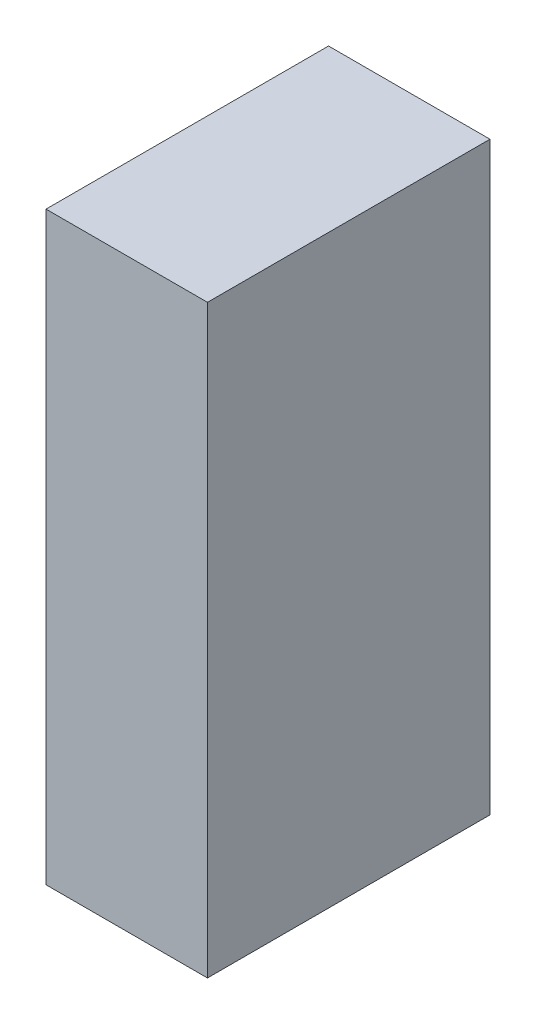
ISO-10303-21;
HEADER;
FILE_DESCRIPTION(('STEP AP214'),'2;1');
FILE_NAME('part.step','',(''),(''),'','','');
FILE_SCHEMA(('AUTOMOTIVE_DESIGN { 1 0 10303 214 1 1 1 1 }'));
ENDSEC;
DATA;
#1=APPLICATION_CONTEXT('core data for automotive mechanical design processes');
#2=APPLICATION_PROTOCOL_DEFINITION('international standard','automotive_design',2000,#1);
#3=PRODUCT_CONTEXT('',#1,'mechanical');
#4=PRODUCT('Part','Part','',(#3));
#5=PRODUCT_RELATED_PRODUCT_CATEGORY('part','',(#4));
#6=PRODUCT_DEFINITION_FORMATION('','',#4);
#7=PRODUCT_DEFINITION_CONTEXT('part definition',#1,'design');
#8=PRODUCT_DEFINITION('design','',#6,#7);
#9=PRODUCT_DEFINITION_SHAPE('','',#8);
#10=(LENGTH_UNIT() NAMED_UNIT(*) SI_UNIT(.MILLI.,.METRE.));
#11=(NAMED_UNIT(*) PLANE_ANGLE_UNIT() SI_UNIT($,.RADIAN.));
#12=(NAMED_UNIT(*) SI_UNIT($,.STERADIAN.) SOLID_ANGLE_UNIT());
#13=UNCERTAINTY_MEASURE_WITH_UNIT(LENGTH_MEASURE(1.E-05),#10,'distance_accuracy_value','');
#14=(GEOMETRIC_REPRESENTATION_CONTEXT(3) GLOBAL_UNCERTAINTY_ASSIGNED_CONTEXT((#13)) GLOBAL_UNIT_ASSIGNED_CONTEXT((#10,
#11,#12)) REPRESENTATION_CONTEXT('',''));
#15=CARTESIAN_POINT('',(0.,0.,0.));
#16=DIRECTION('',(0.,0.,1.));
#17=DIRECTION('',(1.,0.,0.));
#18=AXIS2_PLACEMENT_3D('',#15,#16,#17);
#19=CARTESIAN_POINT('',(-1.09999605486094,0.724992040493987,0.));
#20=DIRECTION('',(-1.,1.19248806385031E-08,0.));
#21=DIRECTION('',(-1.19248806385031E-08,-1.,0.));
#22=AXIS2_PLACEMENT_3D('',#19,#20,#21);
#23=PLANE('',#22);
#24=DIRECTION('',(-1.19248806835723E-08,-1.,0.));
#25=VECTOR('',#24,1.);
#26=CARTESIAN_POINT('',(-1.09999605486094,0.724992040493987,0.));
#27=LINE('',#26,#25);
#28=CARTESIAN_POINT('',(-1.09999605486094,0.724992040493987,0.));
#29=VERTEX_POINT('',#28);
#30=CARTESIAN_POINT('',(-1.09999607215198,-0.7250049077482,0.));
#31=VERTEX_POINT('',#30);
#32=EDGE_CURVE('E11',#29,#31,#27,.T.);
#33=ORIENTED_EDGE('',*,*,#32,.T.);
#34=DIRECTION('',(0.,0.,1.));
#35=VECTOR('',#34,1.);
#36=CARTESIAN_POINT('',(-1.09999607215198,-0.7250049077482,0.));
#37=LINE('',#36,#35);
#38=CARTESIAN_POINT('',(-1.09999607215198,-0.7250049077482,0.700001120567322));
#39=VERTEX_POINT('',#38);
#40=EDGE_CURVE('E88',#31,#39,#37,.T.);
#41=ORIENTED_EDGE('',*,*,#40,.T.);
#42=DIRECTION('',(-1.19248806835723E-08,-1.,0.));
#43=VECTOR('',#42,1.);
#44=CARTESIAN_POINT('',(-1.09999605486094,0.724992040493987,0.700001120567322));
#45=LINE('',#44,#43);
#46=CARTESIAN_POINT('',(-1.09999605486094,0.724992040493987,0.700001120567322));
#47=VERTEX_POINT('',#46);
#48=EDGE_CURVE('E83',#47,#39,#45,.T.);
#49=ORIENTED_EDGE('',*,*,#48,.F.);
#50=DIRECTION('',(0.,0.,1.));
#51=VECTOR('',#50,1.);
#52=CARTESIAN_POINT('',(-1.09999605486094,0.724992040493976,0.));
#53=LINE('',#52,#51);
#54=EDGE_CURVE('E72',#29,#47,#53,.T.);
#55=ORIENTED_EDGE('',*,*,#54,.F.);
#56=EDGE_LOOP('',(#33,#41,#49,#55));
#57=FACE_BOUND('',#56,.T.);
#58=ADVANCED_FACE('F17',(#57),#23,.T.);
#59=CARTESIAN_POINT('',(-1.09999607215198,-0.7250049077482,0.));
#60=DIRECTION('',(-1.19248806385031E-08,-1.,0.));
#61=DIRECTION('',(1.,-1.19248806385031E-08,0.));
#62=AXIS2_PLACEMENT_3D('',#59,#60,#61);
#63=PLANE('',#62);
#64=DIRECTION('',(1.,-1.19248807034859E-08,0.));
#65=VECTOR('',#64,1.);
#66=CARTESIAN_POINT('',(-1.09999607215198,-0.7250049077482,0.));
#67=LINE('',#66,#65);
#68=CARTESIAN_POINT('',(-0.699986916878544,-0.725004912518273,0.));
#69=VERTEX_POINT('',#68);
#70=EDGE_CURVE('E24',#31,#69,#67,.T.);
#71=ORIENTED_EDGE('',*,*,#70,.T.);
#72=DIRECTION('',(0.,0.,1.));
#73=VECTOR('',#72,1.);
#74=CARTESIAN_POINT('',(-0.699986916878544,-0.725004912518262,0.));
#75=LINE('',#74,#73);
#76=CARTESIAN_POINT('',(-0.699986916878544,-0.725004912518273,0.700001120567322));
#77=VERTEX_POINT('',#76);
#78=EDGE_CURVE('E85',#69,#77,#75,.T.);
#79=ORIENTED_EDGE('',*,*,#78,.T.);
#80=DIRECTION('',(1.,-1.19248807034859E-08,0.));
#81=VECTOR('',#80,1.);
#82=CARTESIAN_POINT('',(-1.09999607215198,-0.7250049077482,0.700001120567322));
#83=LINE('',#82,#81);
#84=EDGE_CURVE('E66',#39,#77,#83,.T.);
#85=ORIENTED_EDGE('',*,*,#84,.F.);
#86=ORIENTED_EDGE('',*,*,#40,.F.);
#87=EDGE_LOOP('',(#71,#79,#85,#86));
#88=FACE_BOUND('',#87,.T.);
#89=ADVANCED_FACE('F89',(#88),#63,.T.);
#90=CARTESIAN_POINT('',(-0.699986916878544,-0.725004912518273,0.));
#91=DIRECTION('',(1.,-1.19248806385031E-08,0.));
#92=DIRECTION('',(1.19248806385031E-08,1.,0.));
#93=AXIS2_PLACEMENT_3D('',#90,#91,#92);
#94=PLANE('',#93);
#95=DIRECTION('',(1.1924880607005E-08,1.,0.));
#96=VECTOR('',#95,1.);
#97=CARTESIAN_POINT('',(-0.699986916878544,-0.725004912518273,0.));
#98=LINE('',#97,#96);
#99=CARTESIAN_POINT('',(-0.699986899587501,0.724992035723915,0.));
#100=VERTEX_POINT('',#99);
#101=EDGE_CURVE('E62',#69,#100,#98,.T.);
#102=ORIENTED_EDGE('',*,*,#101,.T.);
#103=DIRECTION('',(0.,0.,1.));
#104=VECTOR('',#103,1.);
#105=CARTESIAN_POINT('',(-0.699986899587503,0.724992035723915,0.));
#106=LINE('',#105,#104);
#107=CARTESIAN_POINT('',(-0.699986899587501,0.724992035723915,0.700001120567322));
#108=VERTEX_POINT('',#107);
#109=EDGE_CURVE('E55',#100,#108,#106,.T.);
#110=ORIENTED_EDGE('',*,*,#109,.T.);
#111=DIRECTION('',(1.1924880607005E-08,1.,0.));
#112=VECTOR('',#111,1.);
#113=CARTESIAN_POINT('',(-0.699986916878544,-0.725004912518273,0.700001120567322));
#114=LINE('',#113,#112);
#115=EDGE_CURVE('E59',#77,#108,#114,.T.);
#116=ORIENTED_EDGE('',*,*,#115,.F.);
#117=ORIENTED_EDGE('',*,*,#78,.F.);
#118=EDGE_LOOP('',(#102,#110,#116,#117));
#119=FACE_BOUND('',#118,.T.);
#120=ADVANCED_FACE('F57',(#119),#94,.T.);
#121=CARTESIAN_POINT('',(-0.699986899587501,0.724992035723915,0.));
#122=DIRECTION('',(1.19248806385031E-08,1.,0.));
#123=DIRECTION('',(-1.,1.19248806385031E-08,0.));
#124=AXIS2_PLACEMENT_3D('',#121,#122,#123);
#125=PLANE('',#124);
#126=DIRECTION('',(-1.,1.19248807034859E-08,0.));
#127=VECTOR('',#126,1.);
#128=CARTESIAN_POINT('',(-0.699986899587501,0.724992035723915,0.));
#129=LINE('',#128,#127);
#130=EDGE_CURVE('E65',#100,#29,#129,.T.);
#131=ORIENTED_EDGE('',*,*,#130,.T.);
#132=ORIENTED_EDGE('',*,*,#54,.T.);
#133=DIRECTION('',(-1.,1.19248807034859E-08,0.));
#134=VECTOR('',#133,1.);
#135=CARTESIAN_POINT('',(-0.699986899587501,0.724992035723915,0.700001120567322));
#136=LINE('',#135,#134);
#137=EDGE_CURVE('E70',#108,#47,#136,.T.);
#138=ORIENTED_EDGE('',*,*,#137,.F.);
#139=ORIENTED_EDGE('',*,*,#109,.F.);
#140=EDGE_LOOP('',(#131,#132,#138,#139));
#141=FACE_BOUND('',#140,.T.);
#142=ADVANCED_FACE('F71',(#141),#125,.T.);
#143=CARTESIAN_POINT('',(99.1750030517578,-202.150009155273,0.700001120567322));
#144=DIRECTION('',(0.,0.,1.));
#145=DIRECTION('',(1.19248806385031E-08,1.,0.));
#146=AXIS2_PLACEMENT_3D('',#143,#144,#145);
#147=PLANE('',#146);
#148=ORIENTED_EDGE('',*,*,#48,.T.);
#149=ORIENTED_EDGE('',*,*,#84,.T.);
#150=ORIENTED_EDGE('',*,*,#115,.T.);
#151=ORIENTED_EDGE('',*,*,#137,.T.);
#152=EDGE_LOOP('',(#148,#149,#150,#151));
#153=FACE_BOUND('',#152,.T.);
#154=ADVANCED_FACE('F76',(#153),#147,.T.);
#155=CARTESIAN_POINT('',(99.1750030517578,-202.150009155273,0.));
#156=DIRECTION('',(0.,0.,1.));
#157=DIRECTION('',(1.19248806385031E-08,1.,0.));
#158=AXIS2_PLACEMENT_3D('',#155,#156,#157);
#159=PLANE('',#158);
#160=ORIENTED_EDGE('',*,*,#130,.F.);
#161=ORIENTED_EDGE('',*,*,#101,.F.);
#162=ORIENTED_EDGE('',*,*,#70,.F.);
#163=ORIENTED_EDGE('',*,*,#32,.F.);
#164=EDGE_LOOP('',(#160,#161,#162,#163));
#165=FACE_BOUND('',#164,.T.);
#166=ADVANCED_FACE('F91',(#165),#159,.F.);
#167=CLOSED_SHELL('',(#58,#89,#120,#142,#154,#166));
#168=MANIFOLD_SOLID_BREP('B1',#167);
#169=ADVANCED_BREP_SHAPE_REPRESENTATION('',(#18,#168),#14);
#170=SHAPE_DEFINITION_REPRESENTATION(#9,#169);
ENDSEC;
END-ISO-10303-21;
